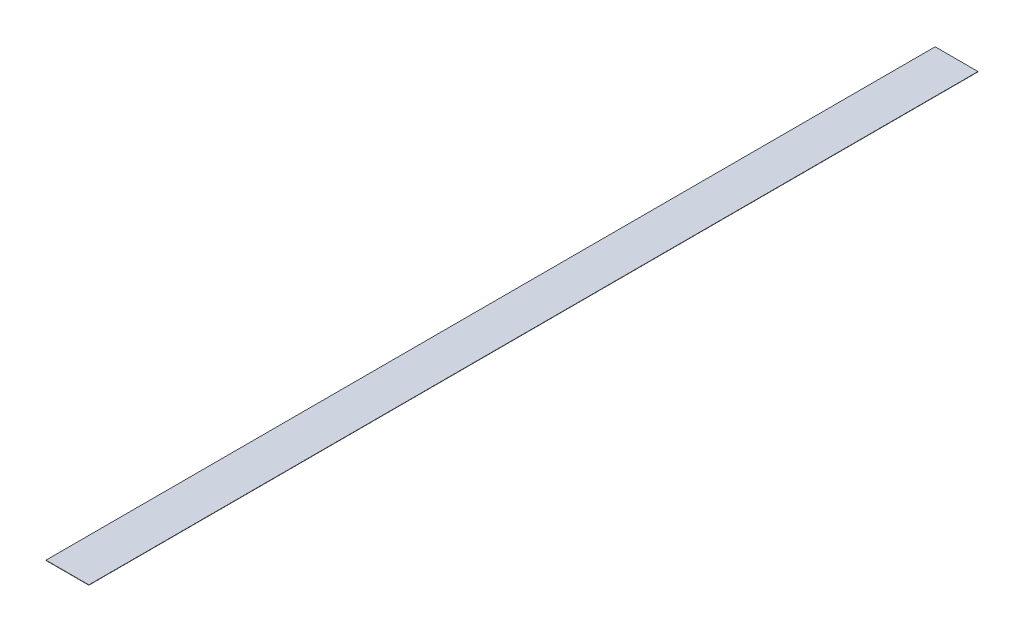
ISO-10303-21;
HEADER;
FILE_DESCRIPTION(('STEP AP214'),'2;1');
FILE_NAME('part.step','',(''),(''),'','','');
FILE_SCHEMA(('AUTOMOTIVE_DESIGN { 1 0 10303 214 1 1 1 1 }'));
ENDSEC;
DATA;
#1=APPLICATION_CONTEXT('core data for automotive mechanical design processes');
#2=APPLICATION_PROTOCOL_DEFINITION('international standard','automotive_design',2000,#1);
#3=PRODUCT_CONTEXT('',#1,'mechanical');
#4=PRODUCT('Part','Part','',(#3));
#5=PRODUCT_RELATED_PRODUCT_CATEGORY('part','',(#4));
#6=PRODUCT_DEFINITION_FORMATION('','',#4);
#7=PRODUCT_DEFINITION_CONTEXT('part definition',#1,'design');
#8=PRODUCT_DEFINITION('design','',#6,#7);
#9=PRODUCT_DEFINITION_SHAPE('','',#8);
#10=(LENGTH_UNIT() NAMED_UNIT(*) SI_UNIT(.MILLI.,.METRE.));
#11=(NAMED_UNIT(*) PLANE_ANGLE_UNIT() SI_UNIT($,.RADIAN.));
#12=(NAMED_UNIT(*) SI_UNIT($,.STERADIAN.) SOLID_ANGLE_UNIT());
#13=UNCERTAINTY_MEASURE_WITH_UNIT(LENGTH_MEASURE(1.E-05),#10,'distance_accuracy_value','');
#14=(GEOMETRIC_REPRESENTATION_CONTEXT(3) GLOBAL_UNCERTAINTY_ASSIGNED_CONTEXT((#13)) GLOBAL_UNIT_ASSIGNED_CONTEXT((#10,
#11,#12)) REPRESENTATION_CONTEXT('',''));
#15=CARTESIAN_POINT('',(0.,0.,0.));
#16=DIRECTION('',(0.,0.,1.));
#17=DIRECTION('',(1.,0.,0.));
#18=AXIS2_PLACEMENT_3D('',#15,#16,#17);
#19=CARTESIAN_POINT('',(-7.20500000000001,0.1,-149.5));
#20=DIRECTION('',(1.,0.,0.));
#21=DIRECTION('',(0.,0.,-1.));
#22=AXIS2_PLACEMENT_3D('',#19,#20,#21);
#23=PLANE('',#22);
#24=DIRECTION('',(0.,0.,1.));
#25=VECTOR('',#24,1.);
#26=CARTESIAN_POINT('',(-7.20500000000001,0.,-149.5));
#27=LINE('',#26,#25);
#28=CARTESIAN_POINT('',(-7.20500000000001,0.,-149.5));
#29=VERTEX_POINT('',#28);
#30=CARTESIAN_POINT('',(-7.20499999999997,0.,149.5));
#31=VERTEX_POINT('',#30);
#32=EDGE_CURVE('E98',#29,#31,#27,.T.);
#33=ORIENTED_EDGE('',*,*,#32,.T.);
#34=DIRECTION('',(0.,-1.,0.));
#35=VECTOR('',#34,1.);
#36=CARTESIAN_POINT('',(-7.20499999999997,0.1,149.5));
#37=LINE('',#36,#35);
#38=CARTESIAN_POINT('',(-7.20499999999997,0.1,149.5));
#39=VERTEX_POINT('',#38);
#40=EDGE_CURVE('E11',#39,#31,#37,.T.);
#41=ORIENTED_EDGE('',*,*,#40,.F.);
#42=DIRECTION('',(0.,0.,1.));
#43=VECTOR('',#42,1.);
#44=CARTESIAN_POINT('',(-7.20500000000001,0.1,-149.5));
#45=LINE('',#44,#43);
#46=CARTESIAN_POINT('',(-7.20500000000001,0.1,-149.5));
#47=VERTEX_POINT('',#46);
#48=EDGE_CURVE('E86',#47,#39,#45,.T.);
#49=ORIENTED_EDGE('',*,*,#48,.F.);
#50=DIRECTION('',(0.,-1.,0.));
#51=VECTOR('',#50,1.);
#52=CARTESIAN_POINT('',(-7.20500000000001,0.1,-149.5));
#53=LINE('',#52,#51);
#54=EDGE_CURVE('E94',#47,#29,#53,.T.);
#55=ORIENTED_EDGE('',*,*,#54,.T.);
#56=EDGE_LOOP('',(#33,#41,#49,#55));
#57=FACE_BOUND('',#56,.T.);
#58=ADVANCED_FACE('F35',(#57),#23,.F.);
#59=CARTESIAN_POINT('',(-7.20499999999997,0.1,149.5));
#60=DIRECTION('',(0.,0.,-1.));
#61=DIRECTION('',(-1.,0.,0.));
#62=AXIS2_PLACEMENT_3D('',#59,#60,#61);
#63=PLANE('',#62);
#64=DIRECTION('',(1.,0.,0.));
#65=VECTOR('',#64,1.);
#66=CARTESIAN_POINT('',(-7.20499999999997,0.,149.5));
#67=LINE('',#66,#65);
#68=CARTESIAN_POINT('',(7.20500000000003,0.,149.5));
#69=VERTEX_POINT('',#68);
#70=EDGE_CURVE('E90',#31,#69,#67,.T.);
#71=ORIENTED_EDGE('',*,*,#70,.T.);
#72=DIRECTION('',(0.,-1.,0.));
#73=VECTOR('',#72,1.);
#74=CARTESIAN_POINT('',(7.20500000000003,0.1,149.5));
#75=LINE('',#74,#73);
#76=CARTESIAN_POINT('',(7.20500000000003,0.1,149.5));
#77=VERTEX_POINT('',#76);
#78=EDGE_CURVE('E43',#77,#69,#75,.T.);
#79=ORIENTED_EDGE('',*,*,#78,.F.);
#80=DIRECTION('',(1.,0.,0.));
#81=VECTOR('',#80,1.);
#82=CARTESIAN_POINT('',(-7.20499999999997,0.1,149.5));
#83=LINE('',#82,#81);
#84=EDGE_CURVE('E81',#39,#77,#83,.T.);
#85=ORIENTED_EDGE('',*,*,#84,.F.);
#86=ORIENTED_EDGE('',*,*,#40,.T.);
#87=EDGE_LOOP('',(#71,#79,#85,#86));
#88=FACE_BOUND('',#87,.T.);
#89=ADVANCED_FACE('F89',(#88),#63,.F.);
#90=CARTESIAN_POINT('',(7.20499999999999,0.1,-149.5));
#91=DIRECTION('',(-1.,0.,0.));
#92=DIRECTION('',(0.,0.,1.));
#93=AXIS2_PLACEMENT_3D('',#90,#91,#92);
#94=PLANE('',#93);
#95=DIRECTION('',(0.,0.,-1.));
#96=VECTOR('',#95,1.);
#97=CARTESIAN_POINT('',(7.20499999999999,0.,-149.5));
#98=LINE('',#97,#96);
#99=CARTESIAN_POINT('',(7.20499999999999,0.,-149.5));
#100=VERTEX_POINT('',#99);
#101=EDGE_CURVE('E68',#69,#100,#98,.T.);
#102=ORIENTED_EDGE('',*,*,#101,.T.);
#103=DIRECTION('',(0.,-1.,0.));
#104=VECTOR('',#103,1.);
#105=CARTESIAN_POINT('',(7.20499999999999,0.1,-149.5));
#106=LINE('',#105,#104);
#107=CARTESIAN_POINT('',(7.20499999999999,0.1,-149.5));
#108=VERTEX_POINT('',#107);
#109=EDGE_CURVE('E91',#108,#100,#106,.T.);
#110=ORIENTED_EDGE('',*,*,#109,.F.);
#111=DIRECTION('',(0.,0.,-1.));
#112=VECTOR('',#111,1.);
#113=CARTESIAN_POINT('',(7.20499999999999,0.1,-149.5));
#114=LINE('',#113,#112);
#115=EDGE_CURVE('E84',#77,#108,#114,.T.);
#116=ORIENTED_EDGE('',*,*,#115,.F.);
#117=ORIENTED_EDGE('',*,*,#78,.T.);
#118=EDGE_LOOP('',(#102,#110,#116,#117));
#119=FACE_BOUND('',#118,.T.);
#120=ADVANCED_FACE('F92',(#119),#94,.F.);
#121=CARTESIAN_POINT('',(-7.20500000000001,0.1,-149.5));
#122=DIRECTION('',(0.,0.,1.));
#123=DIRECTION('',(1.,0.,0.));
#124=AXIS2_PLACEMENT_3D('',#121,#122,#123);
#125=PLANE('',#124);
#126=DIRECTION('',(-1.,0.,0.));
#127=VECTOR('',#126,1.);
#128=CARTESIAN_POINT('',(-7.20500000000001,0.,-149.5));
#129=LINE('',#128,#127);
#130=EDGE_CURVE('E74',#100,#29,#129,.T.);
#131=ORIENTED_EDGE('',*,*,#130,.T.);
#132=ORIENTED_EDGE('',*,*,#54,.F.);
#133=DIRECTION('',(-1.,0.,0.));
#134=VECTOR('',#133,1.);
#135=CARTESIAN_POINT('',(-7.20500000000001,0.1,-149.5));
#136=LINE('',#135,#134);
#137=EDGE_CURVE('E51',#108,#47,#136,.T.);
#138=ORIENTED_EDGE('',*,*,#137,.F.);
#139=ORIENTED_EDGE('',*,*,#109,.T.);
#140=EDGE_LOOP('',(#131,#132,#138,#139));
#141=FACE_BOUND('',#140,.T.);
#142=ADVANCED_FACE('F105',(#141),#125,.F.);
#143=CARTESIAN_POINT('',(-7.20499999999997,0.1,149.5));
#144=DIRECTION('',(0.,1.,0.));
#145=DIRECTION('',(0.,0.,1.));
#146=AXIS2_PLACEMENT_3D('',#143,#144,#145);
#147=PLANE('',#146);
#148=ORIENTED_EDGE('',*,*,#48,.T.);
#149=ORIENTED_EDGE('',*,*,#84,.T.);
#150=ORIENTED_EDGE('',*,*,#115,.T.);
#151=ORIENTED_EDGE('',*,*,#137,.T.);
#152=EDGE_LOOP('',(#148,#149,#150,#151));
#153=FACE_BOUND('',#152,.T.);
#154=ADVANCED_FACE('F82',(#153),#147,.T.);
#155=CARTESIAN_POINT('',(-7.20499999999997,0.,149.5));
#156=DIRECTION('',(0.,1.,0.));
#157=DIRECTION('',(0.,0.,1.));
#158=AXIS2_PLACEMENT_3D('',#155,#156,#157);
#159=PLANE('',#158);
#160=ORIENTED_EDGE('',*,*,#32,.F.);
#161=ORIENTED_EDGE('',*,*,#130,.F.);
#162=ORIENTED_EDGE('',*,*,#101,.F.);
#163=ORIENTED_EDGE('',*,*,#70,.F.);
#164=EDGE_LOOP('',(#160,#161,#162,#163));
#165=FACE_BOUND('',#164,.T.);
#166=ADVANCED_FACE('F108',(#165),#159,.F.);
#167=CLOSED_SHELL('',(#58,#89,#120,#142,#154,#166));
#168=MANIFOLD_SOLID_BREP('B2',#167);
#169=ADVANCED_BREP_SHAPE_REPRESENTATION('',(#18,#168),#14);
#170=SHAPE_DEFINITION_REPRESENTATION(#9,#169);
ENDSEC;
END-ISO-10303-21;
